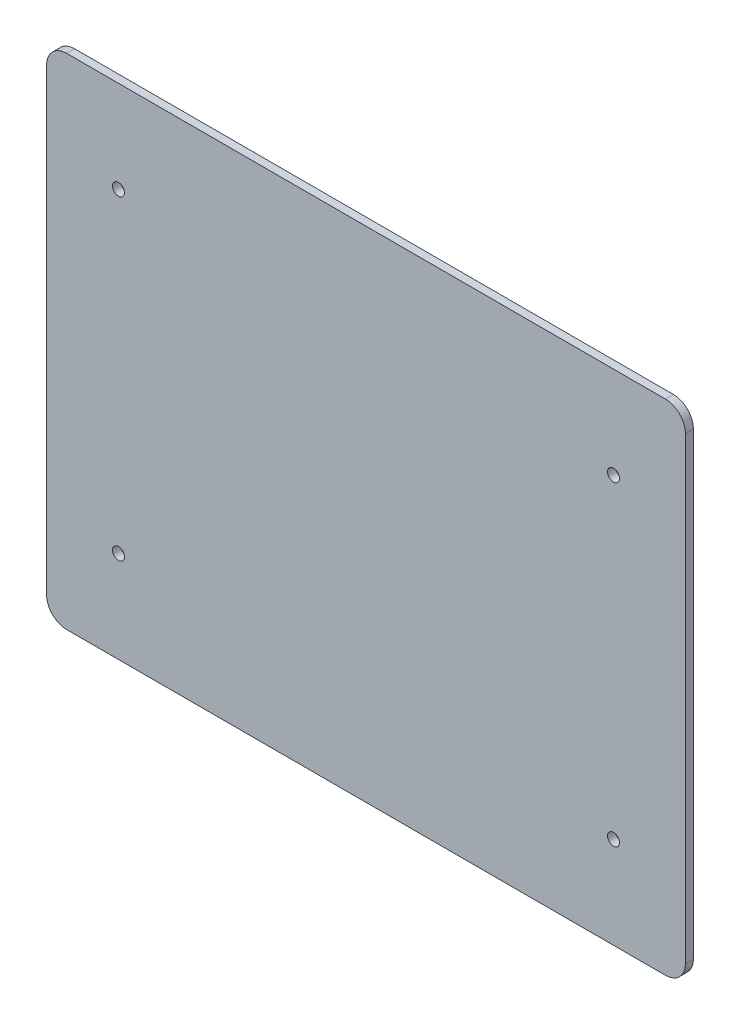
ISO-10303-21;
HEADER;
FILE_DESCRIPTION(('STEP AP214'),'2;1');
FILE_NAME('part.step','',(''),(''),'','','');
FILE_SCHEMA(('AUTOMOTIVE_DESIGN { 1 0 10303 214 1 1 1 1 }'));
ENDSEC;
DATA;
#1=APPLICATION_CONTEXT('core data for automotive mechanical design processes');
#2=APPLICATION_PROTOCOL_DEFINITION('international standard','automotive_design',2000,#1);
#3=PRODUCT_CONTEXT('',#1,'mechanical');
#4=PRODUCT('Part','Part','',(#3));
#5=PRODUCT_RELATED_PRODUCT_CATEGORY('part','',(#4));
#6=PRODUCT_DEFINITION_FORMATION('','',#4);
#7=PRODUCT_DEFINITION_CONTEXT('part definition',#1,'design');
#8=PRODUCT_DEFINITION('design','',#6,#7);
#9=PRODUCT_DEFINITION_SHAPE('','',#8);
#10=(LENGTH_UNIT() NAMED_UNIT(*) SI_UNIT(.MILLI.,.METRE.));
#11=(NAMED_UNIT(*) PLANE_ANGLE_UNIT() SI_UNIT($,.RADIAN.));
#12=(NAMED_UNIT(*) SI_UNIT($,.STERADIAN.) SOLID_ANGLE_UNIT());
#13=UNCERTAINTY_MEASURE_WITH_UNIT(LENGTH_MEASURE(1.E-05),#10,'distance_accuracy_value','');
#14=(GEOMETRIC_REPRESENTATION_CONTEXT(3) GLOBAL_UNCERTAINTY_ASSIGNED_CONTEXT((#13)) GLOBAL_UNIT_ASSIGNED_CONTEXT((#10,
#11,#12)) REPRESENTATION_CONTEXT('',''));
#15=CARTESIAN_POINT('',(0.,0.,0.));
#16=DIRECTION('',(0.,0.,1.));
#17=DIRECTION('',(1.,0.,0.));
#18=AXIS2_PLACEMENT_3D('',#15,#16,#17);
#19=CARTESIAN_POINT('',(-102.632364328177,-143.027068540586,2.));
#20=DIRECTION('',(0.,0.,-1.));
#21=DIRECTION('',(-1.,0.,0.));
#22=AXIS2_PLACEMENT_3D('',#19,#20,#21);
#23=CYLINDRICAL_SURFACE('',#22,5.);
#24=CARTESIAN_POINT('',(-102.632364328177,-143.027068540586,0.));
#25=DIRECTION('',(0.,0.,1.));
#26=DIRECTION('',(-1.,0.,0.));
#27=AXIS2_PLACEMENT_3D('',#24,#25,#26);
#28=CIRCLE('',#27,5.);
#29=CARTESIAN_POINT('',(-107.632364328177,-143.027068540586,0.));
#30=VERTEX_POINT('',#29);
#31=CARTESIAN_POINT('',(-102.632364328177,-148.027068540586,0.));
#32=VERTEX_POINT('',#31);
#33=EDGE_CURVE('E129',#30,#32,#28,.T.);
#34=ORIENTED_EDGE('',*,*,#33,.T.);
#35=DIRECTION('',(0.,0.,-1.));
#36=VECTOR('',#35,1.);
#37=CARTESIAN_POINT('',(-102.632364328177,-148.027068540586,2.));
#38=LINE('',#37,#36);
#39=CARTESIAN_POINT('',(-102.632364328177,-148.027068540586,2.));
#40=VERTEX_POINT('',#39);
#41=EDGE_CURVE('E11',#40,#32,#38,.T.);
#42=ORIENTED_EDGE('',*,*,#41,.F.);
#43=CARTESIAN_POINT('',(-102.632364328177,-143.027068540586,2.));
#44=DIRECTION('',(0.,0.,1.));
#45=DIRECTION('',(-1.,0.,0.));
#46=AXIS2_PLACEMENT_3D('',#43,#44,#45);
#47=CIRCLE('',#46,5.);
#48=CARTESIAN_POINT('',(-107.632364328177,-143.027068540586,2.));
#49=VERTEX_POINT('',#48);
#50=EDGE_CURVE('E144',#49,#40,#47,.T.);
#51=ORIENTED_EDGE('',*,*,#50,.F.);
#52=DIRECTION('',(0.,0.,-1.));
#53=VECTOR('',#52,1.);
#54=CARTESIAN_POINT('',(-107.632364328177,-143.027068540586,2.));
#55=LINE('',#54,#53);
#56=EDGE_CURVE('E125',#49,#30,#55,.T.);
#57=ORIENTED_EDGE('',*,*,#56,.T.);
#58=EDGE_LOOP('',(#34,#42,#51,#57));
#59=FACE_BOUND('',#58,.T.);
#60=ADVANCED_FACE('F33',(#59),#23,.T.);
#61=CARTESIAN_POINT('',(47.367635671823,-148.027068540586,2.));
#62=DIRECTION('',(0.,1.,0.));
#63=DIRECTION('',(0.,0.,1.));
#64=AXIS2_PLACEMENT_3D('',#61,#62,#63);
#65=PLANE('',#64);
#66=DIRECTION('',(1.,0.,0.));
#67=VECTOR('',#66,1.);
#68=CARTESIAN_POINT('',(47.367635671823,-148.027068540586,0.));
#69=LINE('',#68,#67);
#70=CARTESIAN_POINT('',(47.367635671823,-148.027068540586,0.));
#71=VERTEX_POINT('',#70);
#72=EDGE_CURVE('E132',#32,#71,#69,.T.);
#73=ORIENTED_EDGE('',*,*,#72,.T.);
#74=DIRECTION('',(0.,0.,-1.));
#75=VECTOR('',#74,1.);
#76=CARTESIAN_POINT('',(47.367635671823,-148.027068540586,2.));
#77=LINE('',#76,#75);
#78=CARTESIAN_POINT('',(47.367635671823,-148.027068540586,2.));
#79=VERTEX_POINT('',#78);
#80=EDGE_CURVE('E41',#79,#71,#77,.T.);
#81=ORIENTED_EDGE('',*,*,#80,.F.);
#82=DIRECTION('',(1.,0.,0.));
#83=VECTOR('',#82,1.);
#84=CARTESIAN_POINT('',(47.367635671823,-148.027068540586,2.));
#85=LINE('',#84,#83);
#86=EDGE_CURVE('E92',#40,#79,#85,.T.);
#87=ORIENTED_EDGE('',*,*,#86,.F.);
#88=ORIENTED_EDGE('',*,*,#41,.T.);
#89=EDGE_LOOP('',(#73,#81,#87,#88));
#90=FACE_BOUND('',#89,.T.);
#91=ADVANCED_FACE('F230',(#90),#65,.F.);
#92=CARTESIAN_POINT('',(47.3676356718231,-143.027068540586,2.));
#93=DIRECTION('',(0.,0.,-1.));
#94=DIRECTION('',(-1.,0.,0.));
#95=AXIS2_PLACEMENT_3D('',#92,#93,#94);
#96=CYLINDRICAL_SURFACE('',#95,5.);
#97=CARTESIAN_POINT('',(47.3676356718231,-143.027068540586,0.));
#98=DIRECTION('',(0.,0.,1.));
#99=DIRECTION('',(1.,0.,0.));
#100=AXIS2_PLACEMENT_3D('',#97,#98,#99);
#101=CIRCLE('',#100,5.);
#102=CARTESIAN_POINT('',(52.3676356718231,-143.027068540586,0.));
#103=VERTEX_POINT('',#102);
#104=EDGE_CURVE('E135',#71,#103,#101,.T.);
#105=ORIENTED_EDGE('',*,*,#104,.T.);
#106=DIRECTION('',(0.,0.,-1.));
#107=VECTOR('',#106,1.);
#108=CARTESIAN_POINT('',(52.3676356718231,-143.027068540586,2.));
#109=LINE('',#108,#107);
#110=CARTESIAN_POINT('',(52.3676356718231,-143.027068540586,2.));
#111=VERTEX_POINT('',#110);
#112=EDGE_CURVE('E151',#111,#103,#109,.T.);
#113=ORIENTED_EDGE('',*,*,#112,.F.);
#114=CARTESIAN_POINT('',(47.3676356718231,-143.027068540586,2.));
#115=DIRECTION('',(0.,0.,1.));
#116=DIRECTION('',(1.,0.,0.));
#117=AXIS2_PLACEMENT_3D('',#114,#115,#116);
#118=CIRCLE('',#117,5.);
#119=EDGE_CURVE('E159',#79,#111,#118,.T.);
#120=ORIENTED_EDGE('',*,*,#119,.F.);
#121=ORIENTED_EDGE('',*,*,#80,.T.);
#122=EDGE_LOOP('',(#105,#113,#120,#121));
#123=FACE_BOUND('',#122,.T.);
#124=ADVANCED_FACE('F157',(#123),#96,.T.);
#125=CARTESIAN_POINT('',(52.3676356718231,-143.027068540586,2.));
#126=DIRECTION('',(-1.,0.,0.));
#127=DIRECTION('',(0.,-1.,0.));
#128=AXIS2_PLACEMENT_3D('',#125,#126,#127);
#129=PLANE('',#128);
#130=DIRECTION('',(0.,1.,0.));
#131=VECTOR('',#130,1.);
#132=CARTESIAN_POINT('',(52.3676356718231,-143.027068540586,0.));
#133=LINE('',#132,#131);
#134=CARTESIAN_POINT('',(52.3676356718231,-28.0270685405863,0.));
#135=VERTEX_POINT('',#134);
#136=EDGE_CURVE('E137',#103,#135,#133,.T.);
#137=ORIENTED_EDGE('',*,*,#136,.T.);
#138=DIRECTION('',(0.,0.,-1.));
#139=VECTOR('',#138,1.);
#140=CARTESIAN_POINT('',(52.3676356718231,-28.0270685405863,2.));
#141=LINE('',#140,#139);
#142=CARTESIAN_POINT('',(52.3676356718231,-28.0270685405863,2.));
#143=VERTEX_POINT('',#142);
#144=EDGE_CURVE('E148',#143,#135,#141,.T.);
#145=ORIENTED_EDGE('',*,*,#144,.F.);
#146=DIRECTION('',(0.,1.,0.));
#147=VECTOR('',#146,1.);
#148=CARTESIAN_POINT('',(52.3676356718231,-143.027068540586,2.));
#149=LINE('',#148,#147);
#150=EDGE_CURVE('E171',#111,#143,#149,.T.);
#151=ORIENTED_EDGE('',*,*,#150,.F.);
#152=ORIENTED_EDGE('',*,*,#112,.T.);
#153=EDGE_LOOP('',(#137,#145,#151,#152));
#154=FACE_BOUND('',#153,.T.);
#155=ADVANCED_FACE('F167',(#154),#129,.F.);
#156=CARTESIAN_POINT('',(47.3676356718231,-28.0270685405863,2.));
#157=DIRECTION('',(0.,0.,-1.));
#158=DIRECTION('',(-1.,0.,0.));
#159=AXIS2_PLACEMENT_3D('',#156,#157,#158);
#160=CYLINDRICAL_SURFACE('',#159,5.);
#161=CARTESIAN_POINT('',(47.3676356718231,-28.0270685405863,0.));
#162=DIRECTION('',(0.,0.,1.));
#163=DIRECTION('',(1.,0.,0.));
#164=AXIS2_PLACEMENT_3D('',#161,#162,#163);
#165=CIRCLE('',#164,5.);
#166=CARTESIAN_POINT('',(47.3676356718231,-23.0270685405863,0.));
#167=VERTEX_POINT('',#166);
#168=EDGE_CURVE('E139',#135,#167,#165,.T.);
#169=ORIENTED_EDGE('',*,*,#168,.T.);
#170=DIRECTION('',(0.,0.,-1.));
#171=VECTOR('',#170,1.);
#172=CARTESIAN_POINT('',(47.3676356718231,-23.0270685405863,2.));
#173=LINE('',#172,#171);
#174=CARTESIAN_POINT('',(47.3676356718231,-23.0270685405863,2.));
#175=VERTEX_POINT('',#174);
#176=EDGE_CURVE('E120',#175,#167,#173,.T.);
#177=ORIENTED_EDGE('',*,*,#176,.F.);
#178=CARTESIAN_POINT('',(47.3676356718231,-28.0270685405863,2.));
#179=DIRECTION('',(0.,0.,1.));
#180=DIRECTION('',(1.,0.,0.));
#181=AXIS2_PLACEMENT_3D('',#178,#179,#180);
#182=CIRCLE('',#181,5.);
#183=EDGE_CURVE('E111',#143,#175,#182,.T.);
#184=ORIENTED_EDGE('',*,*,#183,.F.);
#185=ORIENTED_EDGE('',*,*,#144,.T.);
#186=EDGE_LOOP('',(#169,#177,#184,#185));
#187=FACE_BOUND('',#186,.T.);
#188=ADVANCED_FACE('F170',(#187),#160,.T.);
#189=CARTESIAN_POINT('',(47.3676356718231,-23.0270685405863,2.));
#190=DIRECTION('',(0.,-1.,0.));
#191=DIRECTION('',(1.,0.,0.));
#192=AXIS2_PLACEMENT_3D('',#189,#190,#191);
#193=PLANE('',#192);
#194=DIRECTION('',(-1.,0.,0.));
#195=VECTOR('',#194,1.);
#196=CARTESIAN_POINT('',(47.3676356718231,-23.0270685405863,0.));
#197=LINE('',#196,#195);
#198=CARTESIAN_POINT('',(-102.632364328177,-23.0270685405863,0.));
#199=VERTEX_POINT('',#198);
#200=EDGE_CURVE('E119',#167,#199,#197,.T.);
#201=ORIENTED_EDGE('',*,*,#200,.T.);
#202=DIRECTION('',(0.,0.,-1.));
#203=VECTOR('',#202,1.);
#204=CARTESIAN_POINT('',(-102.632364328177,-23.0270685405863,2.));
#205=LINE('',#204,#203);
#206=CARTESIAN_POINT('',(-102.632364328177,-23.0270685405863,2.));
#207=VERTEX_POINT('',#206);
#208=EDGE_CURVE('E116',#207,#199,#205,.T.);
#209=ORIENTED_EDGE('',*,*,#208,.F.);
#210=DIRECTION('',(-1.,0.,0.));
#211=VECTOR('',#210,1.);
#212=CARTESIAN_POINT('',(47.3676356718231,-23.0270685405863,2.));
#213=LINE('',#212,#211);
#214=EDGE_CURVE('E105',#175,#207,#213,.T.);
#215=ORIENTED_EDGE('',*,*,#214,.F.);
#216=ORIENTED_EDGE('',*,*,#176,.T.);
#217=EDGE_LOOP('',(#201,#209,#215,#216));
#218=FACE_BOUND('',#217,.T.);
#219=ADVANCED_FACE('F117',(#218),#193,.F.);
#220=CARTESIAN_POINT('',(-102.632364328177,-28.0270685405863,2.));
#221=DIRECTION('',(0.,0.,-1.));
#222=DIRECTION('',(-1.,0.,0.));
#223=AXIS2_PLACEMENT_3D('',#220,#221,#222);
#224=CYLINDRICAL_SURFACE('',#223,5.);
#225=CARTESIAN_POINT('',(-102.632364328177,-28.0270685405863,0.));
#226=DIRECTION('',(0.,0.,1.));
#227=DIRECTION('',(1.,0.,0.));
#228=AXIS2_PLACEMENT_3D('',#225,#226,#227);
#229=CIRCLE('',#228,5.);
#230=CARTESIAN_POINT('',(-107.632364328177,-28.0270685405863,0.));
#231=VERTEX_POINT('',#230);
#232=EDGE_CURVE('E78',#199,#231,#229,.T.);
#233=ORIENTED_EDGE('',*,*,#232,.T.);
#234=DIRECTION('',(0.,0.,-1.));
#235=VECTOR('',#234,1.);
#236=CARTESIAN_POINT('',(-107.632364328177,-28.0270685405863,2.));
#237=LINE('',#236,#235);
#238=CARTESIAN_POINT('',(-107.632364328177,-28.0270685405863,2.));
#239=VERTEX_POINT('',#238);
#240=EDGE_CURVE('E121',#239,#231,#237,.T.);
#241=ORIENTED_EDGE('',*,*,#240,.F.);
#242=CARTESIAN_POINT('',(-102.632364328177,-28.0270685405863,2.));
#243=DIRECTION('',(0.,0.,1.));
#244=DIRECTION('',(1.,0.,0.));
#245=AXIS2_PLACEMENT_3D('',#242,#243,#244);
#246=CIRCLE('',#245,5.);
#247=EDGE_CURVE('E109',#207,#239,#246,.T.);
#248=ORIENTED_EDGE('',*,*,#247,.F.);
#249=ORIENTED_EDGE('',*,*,#208,.T.);
#250=EDGE_LOOP('',(#233,#241,#248,#249));
#251=FACE_BOUND('',#250,.T.);
#252=ADVANCED_FACE('F123',(#251),#224,.T.);
#253=CARTESIAN_POINT('',(-107.632364328177,-143.027068540586,2.));
#254=DIRECTION('',(1.,0.,0.));
#255=DIRECTION('',(0.,0.,-1.));
#256=AXIS2_PLACEMENT_3D('',#253,#254,#255);
#257=PLANE('',#256);
#258=DIRECTION('',(0.,-1.,0.));
#259=VECTOR('',#258,1.);
#260=CARTESIAN_POINT('',(-107.632364328177,-143.027068540586,0.));
#261=LINE('',#260,#259);
#262=EDGE_CURVE('E84',#231,#30,#261,.T.);
#263=ORIENTED_EDGE('',*,*,#262,.T.);
#264=ORIENTED_EDGE('',*,*,#56,.F.);
#265=DIRECTION('',(0.,-1.,0.));
#266=VECTOR('',#265,1.);
#267=CARTESIAN_POINT('',(-107.632364328177,-143.027068540586,2.));
#268=LINE('',#267,#266);
#269=EDGE_CURVE('E49',#239,#49,#268,.T.);
#270=ORIENTED_EDGE('',*,*,#269,.F.);
#271=ORIENTED_EDGE('',*,*,#240,.T.);
#272=EDGE_LOOP('',(#263,#264,#270,#271));
#273=FACE_BOUND('',#272,.T.);
#274=ADVANCED_FACE('F221',(#273),#257,.F.);
#275=CARTESIAN_POINT('',(-102.632364328177,-143.027068540586,2.));
#276=DIRECTION('',(0.,0.,-1.));
#277=DIRECTION('',(-1.,0.,0.));
#278=AXIS2_PLACEMENT_3D('',#275,#276,#277);
#279=PLANE('',#278);
#280=CARTESIAN_POINT('',(34.3676356718231,-46.0270685405863,2.));
#281=DIRECTION('',(0.,0.,-1.));
#282=DIRECTION('',(-1.,0.,0.));
#283=AXIS2_PLACEMENT_3D('',#280,#281,#282);
#284=CIRCLE('',#283,1.5);
#285=CARTESIAN_POINT('',(32.8676356718231,-46.0270685405863,2.));
#286=VERTEX_POINT('',#285);
#287=EDGE_CURVE('E182',#286,#286,#284,.T.);
#288=ORIENTED_EDGE('',*,*,#287,.T.);
#289=EDGE_LOOP('',(#288));
#290=FACE_BOUND('',#289,.T.);
#291=CARTESIAN_POINT('',(-89.6323643281769,-46.0270685405863,2.));
#292=DIRECTION('',(0.,0.,-1.));
#293=DIRECTION('',(-1.,0.,0.));
#294=AXIS2_PLACEMENT_3D('',#291,#292,#293);
#295=CIRCLE('',#294,1.50000000000003);
#296=CARTESIAN_POINT('',(-91.1323643281769,-46.0270685405863,2.));
#297=VERTEX_POINT('',#296);
#298=EDGE_CURVE('E185',#297,#297,#295,.T.);
#299=ORIENTED_EDGE('',*,*,#298,.T.);
#300=EDGE_LOOP('',(#299));
#301=FACE_BOUND('',#300,.T.);
#302=CARTESIAN_POINT('',(-89.6323643281769,-125.027068540586,2.));
#303=DIRECTION('',(0.,0.,-1.));
#304=DIRECTION('',(-1.,0.,0.));
#305=AXIS2_PLACEMENT_3D('',#302,#303,#304);
#306=CIRCLE('',#305,1.50000000000003);
#307=CARTESIAN_POINT('',(-91.1323643281769,-125.027068540586,2.));
#308=VERTEX_POINT('',#307);
#309=EDGE_CURVE('E188',#308,#308,#306,.T.);
#310=ORIENTED_EDGE('',*,*,#309,.T.);
#311=EDGE_LOOP('',(#310));
#312=FACE_BOUND('',#311,.T.);
#313=CARTESIAN_POINT('',(34.3676356718231,-125.027068540586,2.));
#314=DIRECTION('',(0.,0.,-1.));
#315=DIRECTION('',(-1.,0.,0.));
#316=AXIS2_PLACEMENT_3D('',#313,#314,#315);
#317=CIRCLE('',#316,1.5);
#318=CARTESIAN_POINT('',(32.8676356718231,-125.027068540586,2.));
#319=VERTEX_POINT('',#318);
#320=EDGE_CURVE('E133',#319,#319,#317,.T.);
#321=ORIENTED_EDGE('',*,*,#320,.T.);
#322=EDGE_LOOP('',(#321));
#323=FACE_BOUND('',#322,.T.);
#324=ORIENTED_EDGE('',*,*,#50,.T.);
#325=ORIENTED_EDGE('',*,*,#86,.T.);
#326=ORIENTED_EDGE('',*,*,#119,.T.);
#327=ORIENTED_EDGE('',*,*,#150,.T.);
#328=ORIENTED_EDGE('',*,*,#183,.T.);
#329=ORIENTED_EDGE('',*,*,#214,.T.);
#330=ORIENTED_EDGE('',*,*,#247,.T.);
#331=ORIENTED_EDGE('',*,*,#269,.T.);
#332=EDGE_LOOP('',(#324,#325,#326,#327,#328,#329,#330,#331));
#333=FACE_BOUND('',#332,.T.);
#334=ADVANCED_FACE('F107',(#290,#301,#312,#323,#333),#279,.F.);
#335=CARTESIAN_POINT('',(-102.632364328177,-143.027068540586,0.));
#336=DIRECTION('',(0.,0.,-1.));
#337=DIRECTION('',(-1.,0.,0.));
#338=AXIS2_PLACEMENT_3D('',#335,#336,#337);
#339=PLANE('',#338);
#340=CARTESIAN_POINT('',(34.3676356718231,-46.0270685405863,0.));
#341=DIRECTION('',(0.,0.,-1.));
#342=DIRECTION('',(-1.,0.,0.));
#343=AXIS2_PLACEMENT_3D('',#340,#341,#342);
#344=CIRCLE('',#343,1.5);
#345=CARTESIAN_POINT('',(32.8676356718231,-46.0270685405863,0.));
#346=VERTEX_POINT('',#345);
#347=EDGE_CURVE('E191',#346,#346,#344,.T.);
#348=ORIENTED_EDGE('',*,*,#347,.F.);
#349=EDGE_LOOP('',(#348));
#350=FACE_BOUND('',#349,.T.);
#351=CARTESIAN_POINT('',(-89.6323643281769,-46.0270685405863,0.));
#352=DIRECTION('',(0.,0.,-1.));
#353=DIRECTION('',(1.,0.,0.));
#354=AXIS2_PLACEMENT_3D('',#351,#352,#353);
#355=CIRCLE('',#354,1.50000000000003);
#356=CARTESIAN_POINT('',(-88.1323643281769,-46.0270685405863,0.));
#357=VERTEX_POINT('',#356);
#358=EDGE_CURVE('E195',#357,#357,#355,.T.);
#359=ORIENTED_EDGE('',*,*,#358,.F.);
#360=EDGE_LOOP('',(#359));
#361=FACE_BOUND('',#360,.T.);
#362=CARTESIAN_POINT('',(-89.6323643281769,-125.027068540586,0.));
#363=DIRECTION('',(0.,0.,-1.));
#364=DIRECTION('',(1.,0.,0.));
#365=AXIS2_PLACEMENT_3D('',#362,#363,#364);
#366=CIRCLE('',#365,1.50000000000003);
#367=CARTESIAN_POINT('',(-88.1323643281769,-125.027068540586,0.));
#368=VERTEX_POINT('',#367);
#369=EDGE_CURVE('E192',#368,#368,#366,.T.);
#370=ORIENTED_EDGE('',*,*,#369,.F.);
#371=EDGE_LOOP('',(#370));
#372=FACE_BOUND('',#371,.T.);
#373=CARTESIAN_POINT('',(34.3676356718231,-125.027068540586,0.));
#374=DIRECTION('',(0.,0.,-1.));
#375=DIRECTION('',(-1.,0.,0.));
#376=AXIS2_PLACEMENT_3D('',#373,#374,#375);
#377=CIRCLE('',#376,1.5);
#378=CARTESIAN_POINT('',(32.8676356718231,-125.027068540586,0.));
#379=VERTEX_POINT('',#378);
#380=EDGE_CURVE('E179',#379,#379,#377,.T.);
#381=ORIENTED_EDGE('',*,*,#380,.F.);
#382=EDGE_LOOP('',(#381));
#383=FACE_BOUND('',#382,.T.);
#384=ORIENTED_EDGE('',*,*,#33,.F.);
#385=ORIENTED_EDGE('',*,*,#262,.F.);
#386=ORIENTED_EDGE('',*,*,#232,.F.);
#387=ORIENTED_EDGE('',*,*,#200,.F.);
#388=ORIENTED_EDGE('',*,*,#168,.F.);
#389=ORIENTED_EDGE('',*,*,#136,.F.);
#390=ORIENTED_EDGE('',*,*,#104,.F.);
#391=ORIENTED_EDGE('',*,*,#72,.F.);
#392=EDGE_LOOP('',(#384,#385,#386,#387,#388,#389,#390,#391));
#393=FACE_BOUND('',#392,.T.);
#394=ADVANCED_FACE('F163',(#350,#361,#372,#383,#393),#339,.T.);
#395=CARTESIAN_POINT('',(34.3676356718231,-125.027068540586,10.));
#396=DIRECTION('',(0.,0.,-1.));
#397=DIRECTION('',(-1.,0.,0.));
#398=AXIS2_PLACEMENT_3D('',#395,#396,#397);
#399=CYLINDRICAL_SURFACE('',#398,1.5);
#400=ORIENTED_EDGE('',*,*,#380,.T.);
#401=EDGE_LOOP('',(#400));
#402=FACE_BOUND('',#401,.T.);
#403=ORIENTED_EDGE('',*,*,#320,.F.);
#404=EDGE_LOOP('',(#403));
#405=FACE_BOUND('',#404,.T.);
#406=ADVANCED_FACE('F206',(#402,#405),#399,.F.);
#407=CARTESIAN_POINT('',(-89.6323643281769,-125.027068540586,10.));
#408=DIRECTION('',(0.,0.,-1.));
#409=DIRECTION('',(-1.,0.,0.));
#410=AXIS2_PLACEMENT_3D('',#407,#408,#409);
#411=CYLINDRICAL_SURFACE('',#410,1.50000000000003);
#412=ORIENTED_EDGE('',*,*,#369,.T.);
#413=EDGE_LOOP('',(#412));
#414=FACE_BOUND('',#413,.T.);
#415=ORIENTED_EDGE('',*,*,#309,.F.);
#416=EDGE_LOOP('',(#415));
#417=FACE_BOUND('',#416,.T.);
#418=ADVANCED_FACE('F216',(#414,#417),#411,.F.);
#419=CARTESIAN_POINT('',(-89.6323643281769,-46.0270685405863,10.));
#420=DIRECTION('',(0.,0.,-1.));
#421=DIRECTION('',(-1.,0.,0.));
#422=AXIS2_PLACEMENT_3D('',#419,#420,#421);
#423=CYLINDRICAL_SURFACE('',#422,1.50000000000003);
#424=ORIENTED_EDGE('',*,*,#358,.T.);
#425=EDGE_LOOP('',(#424));
#426=FACE_BOUND('',#425,.T.);
#427=ORIENTED_EDGE('',*,*,#298,.F.);
#428=EDGE_LOOP('',(#427));
#429=FACE_BOUND('',#428,.T.);
#430=ADVANCED_FACE('F282',(#426,#429),#423,.F.);
#431=CARTESIAN_POINT('',(34.3676356718231,-46.0270685405863,10.));
#432=DIRECTION('',(0.,0.,-1.));
#433=DIRECTION('',(-1.,0.,0.));
#434=AXIS2_PLACEMENT_3D('',#431,#432,#433);
#435=CYLINDRICAL_SURFACE('',#434,1.5);
#436=ORIENTED_EDGE('',*,*,#347,.T.);
#437=EDGE_LOOP('',(#436));
#438=FACE_BOUND('',#437,.T.);
#439=ORIENTED_EDGE('',*,*,#287,.F.);
#440=EDGE_LOOP('',(#439));
#441=FACE_BOUND('',#440,.T.);
#442=ADVANCED_FACE('F201',(#438,#441),#435,.F.);
#443=CLOSED_SHELL('',(#60,#91,#124,#155,#188,#219,#252,#274,#334,#394,#406,#418,#430,#442));
#444=MANIFOLD_SOLID_BREP('B2',#443);
#445=ADVANCED_BREP_SHAPE_REPRESENTATION('',(#18,#444),#14);
#446=SHAPE_DEFINITION_REPRESENTATION(#9,#445);
ENDSEC;
END-ISO-10303-21;
